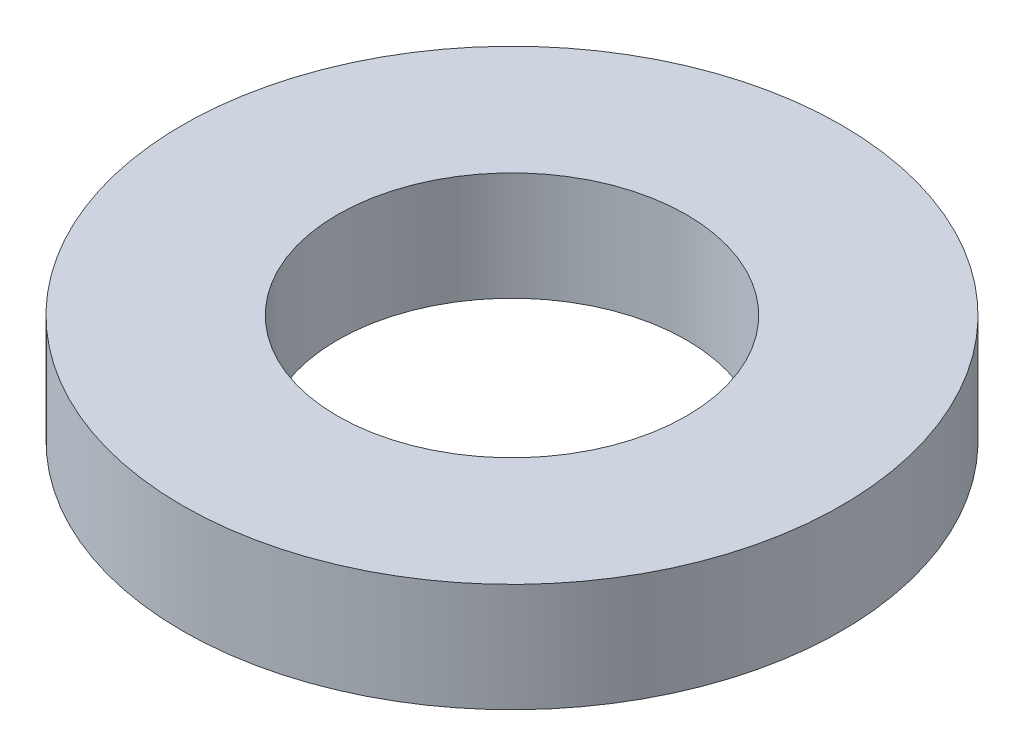
ISO-10303-21;
HEADER;
FILE_DESCRIPTION(('STEP AP214'),'2;1');
FILE_NAME('part.step','',(''),(''),'','','');
FILE_SCHEMA(('AUTOMOTIVE_DESIGN { 1 0 10303 214 1 1 1 1 }'));
ENDSEC;
DATA;
#1=APPLICATION_CONTEXT('core data for automotive mechanical design processes');
#2=APPLICATION_PROTOCOL_DEFINITION('international standard','automotive_design',2000,#1);
#3=PRODUCT_CONTEXT('',#1,'mechanical');
#4=PRODUCT('Part','Part','',(#3));
#5=PRODUCT_RELATED_PRODUCT_CATEGORY('part','',(#4));
#6=PRODUCT_DEFINITION_FORMATION('','',#4);
#7=PRODUCT_DEFINITION_CONTEXT('part definition',#1,'design');
#8=PRODUCT_DEFINITION('design','',#6,#7);
#9=PRODUCT_DEFINITION_SHAPE('','',#8);
#10=(LENGTH_UNIT() NAMED_UNIT(*) SI_UNIT(.MILLI.,.METRE.));
#11=(NAMED_UNIT(*) PLANE_ANGLE_UNIT() SI_UNIT($,.RADIAN.));
#12=(NAMED_UNIT(*) SI_UNIT($,.STERADIAN.) SOLID_ANGLE_UNIT());
#13=UNCERTAINTY_MEASURE_WITH_UNIT(LENGTH_MEASURE(1.E-05),#10,'distance_accuracy_value','');
#14=(GEOMETRIC_REPRESENTATION_CONTEXT(3) GLOBAL_UNCERTAINTY_ASSIGNED_CONTEXT((#13)) GLOBAL_UNIT_ASSIGNED_CONTEXT((#10,
#11,#12)) REPRESENTATION_CONTEXT('',''));
#15=CARTESIAN_POINT('',(0.,0.,0.));
#16=DIRECTION('',(0.,0.,1.));
#17=DIRECTION('',(1.,0.,0.));
#18=AXIS2_PLACEMENT_3D('',#15,#16,#17);
#19=CARTESIAN_POINT('',(0.,28.,0.));
#20=DIRECTION('',(0.,-1.,0.));
#21=DIRECTION('',(0.,0.,-1.));
#22=AXIS2_PLACEMENT_3D('',#19,#20,#21);
#23=CYLINDRICAL_SURFACE('',#22,85.);
#24=CARTESIAN_POINT('',(0.,28.,0.));
#25=DIRECTION('',(0.,1.,0.));
#26=DIRECTION('',(0.,0.,1.));
#27=AXIS2_PLACEMENT_3D('',#24,#25,#26);
#28=CIRCLE('',#27,85.);
#29=CARTESIAN_POINT('',(0.,28.,85.));
#30=VERTEX_POINT('',#29);
#31=EDGE_CURVE('E10',#30,#30,#28,.T.);
#32=ORIENTED_EDGE('',*,*,#31,.F.);
#33=EDGE_LOOP('',(#32));
#34=FACE_BOUND('',#33,.T.);
#35=CARTESIAN_POINT('',(0.,0.,0.));
#36=DIRECTION('',(0.,1.,0.));
#37=DIRECTION('',(0.,0.,1.));
#38=AXIS2_PLACEMENT_3D('',#35,#36,#37);
#39=CIRCLE('',#38,85.);
#40=CARTESIAN_POINT('',(0.,0.,85.));
#41=VERTEX_POINT('',#40);
#42=EDGE_CURVE('E37',#41,#41,#39,.T.);
#43=ORIENTED_EDGE('',*,*,#42,.T.);
#44=EDGE_LOOP('',(#43));
#45=FACE_BOUND('',#44,.T.);
#46=ADVANCED_FACE('F40',(#34,#45),#23,.T.);
#47=CARTESIAN_POINT('',(0.,28.,0.));
#48=DIRECTION('',(0.,1.,0.));
#49=DIRECTION('',(0.,0.,1.));
#50=AXIS2_PLACEMENT_3D('',#47,#48,#49);
#51=PLANE('',#50);
#52=CARTESIAN_POINT('',(0.,28.,0.));
#53=DIRECTION('',(0.,1.,0.));
#54=DIRECTION('',(0.,0.,1.));
#55=AXIS2_PLACEMENT_3D('',#52,#53,#54);
#56=CIRCLE('',#55,45.);
#57=CARTESIAN_POINT('',(0.,28.,45.));
#58=VERTEX_POINT('',#57);
#59=EDGE_CURVE('E50',#58,#58,#56,.T.);
#60=ORIENTED_EDGE('',*,*,#59,.F.);
#61=EDGE_LOOP('',(#60));
#62=FACE_BOUND('',#61,.T.);
#63=ORIENTED_EDGE('',*,*,#31,.T.);
#64=EDGE_LOOP('',(#63));
#65=FACE_BOUND('',#64,.T.);
#66=ADVANCED_FACE('F59',(#62,#65),#51,.T.);
#67=CARTESIAN_POINT('',(0.,0.,0.));
#68=DIRECTION('',(0.,1.,0.));
#69=DIRECTION('',(0.,0.,1.));
#70=AXIS2_PLACEMENT_3D('',#67,#68,#69);
#71=PLANE('',#70);
#72=CARTESIAN_POINT('',(0.,0.,0.));
#73=DIRECTION('',(0.,1.,0.));
#74=DIRECTION('',(0.,0.,1.));
#75=AXIS2_PLACEMENT_3D('',#72,#73,#74);
#76=CIRCLE('',#75,45.);
#77=CARTESIAN_POINT('',(0.,0.,45.));
#78=VERTEX_POINT('',#77);
#79=EDGE_CURVE('E47',#78,#78,#76,.T.);
#80=ORIENTED_EDGE('',*,*,#79,.T.);
#81=EDGE_LOOP('',(#80));
#82=FACE_BOUND('',#81,.T.);
#83=ORIENTED_EDGE('',*,*,#42,.F.);
#84=EDGE_LOOP('',(#83));
#85=FACE_BOUND('',#84,.T.);
#86=ADVANCED_FACE('F58',(#82,#85),#71,.F.);
#87=CARTESIAN_POINT('',(0.,28.,0.));
#88=DIRECTION('',(0.,-1.,0.));
#89=DIRECTION('',(0.,0.,-1.));
#90=AXIS2_PLACEMENT_3D('',#87,#88,#89);
#91=CYLINDRICAL_SURFACE('',#90,45.);
#92=ORIENTED_EDGE('',*,*,#59,.T.);
#93=EDGE_LOOP('',(#92));
#94=FACE_BOUND('',#93,.T.);
#95=ORIENTED_EDGE('',*,*,#79,.F.);
#96=EDGE_LOOP('',(#95));
#97=FACE_BOUND('',#96,.T.);
#98=ADVANCED_FACE('F54',(#94,#97),#91,.F.);
#99=CLOSED_SHELL('',(#46,#66,#86,#98));
#100=MANIFOLD_SOLID_BREP('B2',#99);
#101=ADVANCED_BREP_SHAPE_REPRESENTATION('',(#18,#100),#14);
#102=SHAPE_DEFINITION_REPRESENTATION(#9,#101);
ENDSEC;
END-ISO-10303-21;
